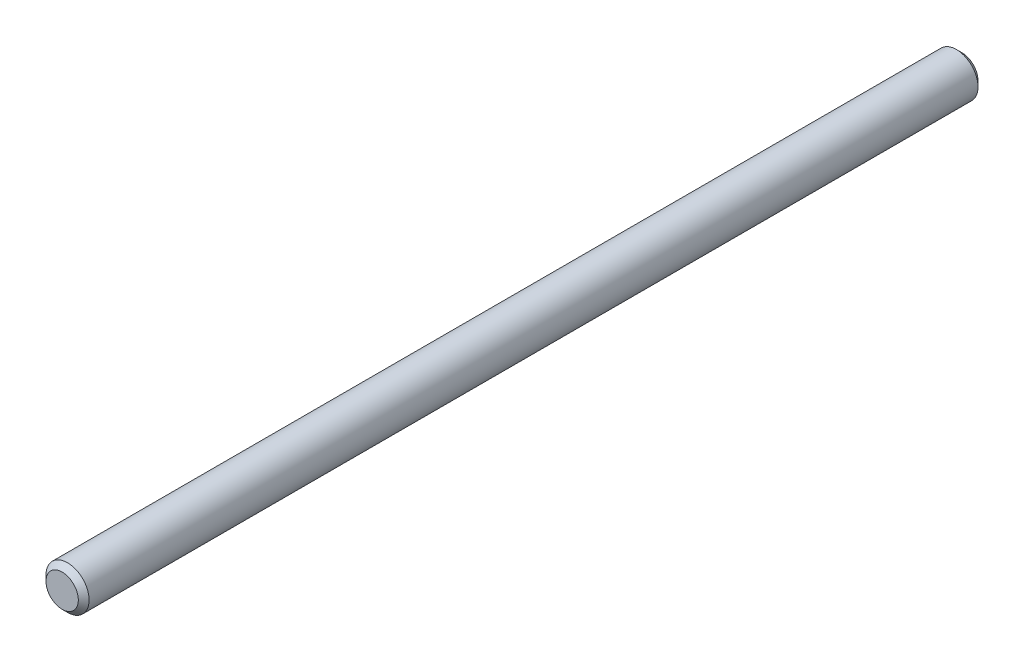
ISO-10303-21;
HEADER;
FILE_DESCRIPTION(('STEP AP214'),'2;1');
FILE_NAME('part.step','',(''),(''),'','','');
FILE_SCHEMA(('AUTOMOTIVE_DESIGN { 1 0 10303 214 1 1 1 1 }'));
ENDSEC;
DATA;
#1=APPLICATION_CONTEXT('core data for automotive mechanical design processes');
#2=APPLICATION_PROTOCOL_DEFINITION('international standard','automotive_design',2000,#1);
#3=PRODUCT_CONTEXT('',#1,'mechanical');
#4=PRODUCT('Part','Part','',(#3));
#5=PRODUCT_RELATED_PRODUCT_CATEGORY('part','',(#4));
#6=PRODUCT_DEFINITION_FORMATION('','',#4);
#7=PRODUCT_DEFINITION_CONTEXT('part definition',#1,'design');
#8=PRODUCT_DEFINITION('design','',#6,#7);
#9=PRODUCT_DEFINITION_SHAPE('','',#8);
#10=(LENGTH_UNIT() NAMED_UNIT(*) SI_UNIT(.MILLI.,.METRE.));
#11=(NAMED_UNIT(*) PLANE_ANGLE_UNIT() SI_UNIT($,.RADIAN.));
#12=(NAMED_UNIT(*) SI_UNIT($,.STERADIAN.) SOLID_ANGLE_UNIT());
#13=UNCERTAINTY_MEASURE_WITH_UNIT(LENGTH_MEASURE(1.E-05),#10,'distance_accuracy_value','');
#14=(GEOMETRIC_REPRESENTATION_CONTEXT(3) GLOBAL_UNCERTAINTY_ASSIGNED_CONTEXT((#13)) GLOBAL_UNIT_ASSIGNED_CONTEXT((#10,
#11,#12)) REPRESENTATION_CONTEXT('',''));
#15=CARTESIAN_POINT('',(0.,0.,0.));
#16=DIRECTION('',(0.,0.,1.));
#17=DIRECTION('',(1.,0.,0.));
#18=AXIS2_PLACEMENT_3D('',#15,#16,#17);
#19=CARTESIAN_POINT('',(0.,0.,243.194937575775));
#20=DIRECTION('',(0.,0.,-1.));
#21=DIRECTION('',(-1.,0.,0.));
#22=AXIS2_PLACEMENT_3D('',#19,#20,#21);
#23=CYLINDRICAL_SURFACE('',#22,4.00000000000002);
#24=CARTESIAN_POINT('',(0.,0.,230.881229076791));
#25=DIRECTION('',(0.,0.,1.));
#26=DIRECTION('',(1.,0.,0.));
#27=AXIS2_PLACEMENT_3D('',#24,#25,#26);
#28=CIRCLE('',#27,4.00000000000002);
#29=CARTESIAN_POINT('',(4.,0.,230.881229076791));
#30=VERTEX_POINT('',#29);
#31=EDGE_CURVE('E40',#30,#30,#28,.F.);
#32=ORIENTED_EDGE('',*,*,#31,.T.);
#33=EDGE_LOOP('',(#32));
#34=FACE_BOUND('',#33,.T.);
#35=CARTESIAN_POINT('',(0.,0.,65.8812290767905));
#36=DIRECTION('',(0.,0.,1.));
#37=DIRECTION('',(1.,0.,0.));
#38=AXIS2_PLACEMENT_3D('',#35,#36,#37);
#39=CIRCLE('',#38,4.00000000000002);
#40=CARTESIAN_POINT('',(4.,0.,65.8812290767905));
#41=VERTEX_POINT('',#40);
#42=EDGE_CURVE('E44',#41,#41,#39,.T.);
#43=ORIENTED_EDGE('',*,*,#42,.T.);
#44=EDGE_LOOP('',(#43));
#45=FACE_BOUND('',#44,.T.);
#46=ADVANCED_FACE('F33',(#34,#45),#23,.T.);
#47=CARTESIAN_POINT('',(0.,0.,64.8812290767905));
#48=DIRECTION('',(0.,0.,1.));
#49=DIRECTION('',(1.,0.,0.));
#50=AXIS2_PLACEMENT_3D('',#47,#48,#49);
#51=PLANE('',#50);
#52=CARTESIAN_POINT('',(0.,0.,64.8812290767905));
#53=DIRECTION('',(0.,0.,1.));
#54=DIRECTION('',(1.,0.,0.));
#55=AXIS2_PLACEMENT_3D('',#52,#53,#54);
#56=CIRCLE('',#55,3.00000000000006);
#57=CARTESIAN_POINT('',(3.00000000000004,0.,64.8812290767905));
#58=VERTEX_POINT('',#57);
#59=EDGE_CURVE('E10',#58,#58,#56,.F.);
#60=ORIENTED_EDGE('',*,*,#59,.T.);
#61=EDGE_LOOP('',(#60));
#62=FACE_BOUND('',#61,.T.);
#63=ADVANCED_FACE('F64',(#62),#51,.F.);
#64=CARTESIAN_POINT('',(14.5322916509722,-11.0672739482671,231.881229076791));
#65=DIRECTION('',(0.,0.,1.));
#66=DIRECTION('',(0.538496681345444,0.842627630795444,0.));
#67=AXIS2_PLACEMENT_3D('',#64,#65,#66);
#68=PLANE('',#67);
#69=CARTESIAN_POINT('',(0.,0.,231.881229076791));
#70=DIRECTION('',(0.,0.,1.));
#71=DIRECTION('',(0.,-1.,0.));
#72=AXIS2_PLACEMENT_3D('',#69,#70,#71);
#73=CIRCLE('',#72,3.00000000000002);
#74=CARTESIAN_POINT('',(0.,-3.00000000000005,231.881229076791));
#75=VERTEX_POINT('',#74);
#76=EDGE_CURVE('E48',#75,#75,#73,.T.);
#77=ORIENTED_EDGE('',*,*,#76,.T.);
#78=EDGE_LOOP('',(#77));
#79=FACE_BOUND('',#78,.T.);
#80=ADVANCED_FACE('F54',(#79),#68,.T.);
#81=CARTESIAN_POINT('',(0.,0.,231.881229076791));
#82=DIRECTION('',(0.,0.,-1.));
#83=DIRECTION('',(-1.,0.,0.));
#84=AXIS2_PLACEMENT_3D('',#81,#82,#83);
#85=CONICAL_SURFACE('',#84,3.00000000000001,0.78539816339744);
#86=ORIENTED_EDGE('',*,*,#31,.F.);
#87=EDGE_LOOP('',(#86));
#88=FACE_BOUND('',#87,.T.);
#89=ORIENTED_EDGE('',*,*,#76,.F.);
#90=EDGE_LOOP('',(#89));
#91=FACE_BOUND('',#90,.T.);
#92=ADVANCED_FACE('F56',(#88,#91),#85,.T.);
#93=CARTESIAN_POINT('',(0.,0.,65.8812290767905));
#94=DIRECTION('',(0.,0.,1.));
#95=DIRECTION('',(1.,0.,0.));
#96=AXIS2_PLACEMENT_3D('',#93,#94,#95);
#97=CONICAL_SURFACE('',#96,4.00000000000002,0.785398163397437);
#98=ORIENTED_EDGE('',*,*,#59,.F.);
#99=EDGE_LOOP('',(#98));
#100=FACE_BOUND('',#99,.T.);
#101=ORIENTED_EDGE('',*,*,#42,.F.);
#102=EDGE_LOOP('',(#101));
#103=FACE_BOUND('',#102,.T.);
#104=ADVANCED_FACE('F35',(#100,#103),#97,.T.);
#105=CLOSED_SHELL('',(#46,#63,#80,#92,#104));
#106=MANIFOLD_SOLID_BREP('B2',#105);
#107=ADVANCED_BREP_SHAPE_REPRESENTATION('',(#18,#106),#14);
#108=SHAPE_DEFINITION_REPRESENTATION(#9,#107);
ENDSEC;
END-ISO-10303-21;
